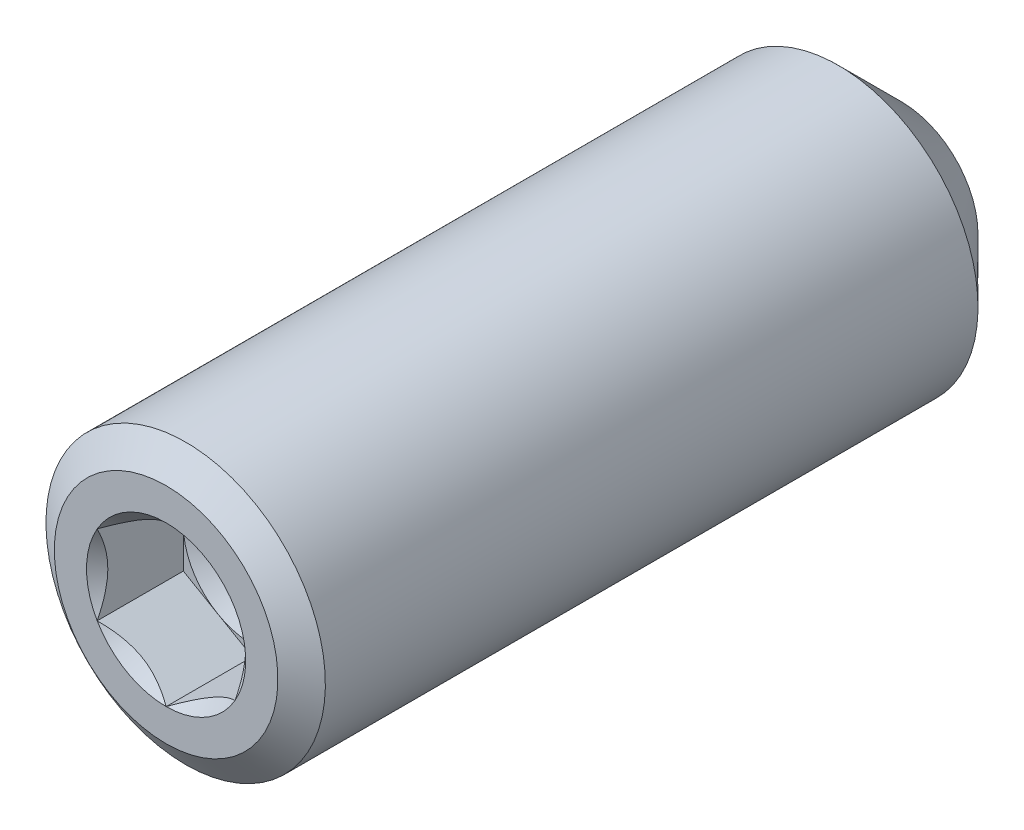
ISO-10303-21;
HEADER;
FILE_DESCRIPTION(('STEP AP214'),'2;1');
FILE_NAME('part.step','',(''),(''),'','','');
FILE_SCHEMA(('AUTOMOTIVE_DESIGN { 1 0 10303 214 1 1 1 1 }'));
ENDSEC;
DATA;
#1=APPLICATION_CONTEXT('core data for automotive mechanical design processes');
#2=APPLICATION_PROTOCOL_DEFINITION('international standard','automotive_design',2000,#1);
#3=PRODUCT_CONTEXT('',#1,'mechanical');
#4=PRODUCT('Part','Part','',(#3));
#5=PRODUCT_RELATED_PRODUCT_CATEGORY('part','',(#4));
#6=PRODUCT_DEFINITION_FORMATION('','',#4);
#7=PRODUCT_DEFINITION_CONTEXT('part definition',#1,'design');
#8=PRODUCT_DEFINITION('design','',#6,#7);
#9=PRODUCT_DEFINITION_SHAPE('','',#8);
#10=(LENGTH_UNIT() NAMED_UNIT(*) SI_UNIT(.MILLI.,.METRE.));
#11=(NAMED_UNIT(*) PLANE_ANGLE_UNIT() SI_UNIT($,.RADIAN.));
#12=(NAMED_UNIT(*) SI_UNIT($,.STERADIAN.) SOLID_ANGLE_UNIT());
#13=UNCERTAINTY_MEASURE_WITH_UNIT(LENGTH_MEASURE(1.E-05),#10,'distance_accuracy_value','');
#14=(GEOMETRIC_REPRESENTATION_CONTEXT(3) GLOBAL_UNCERTAINTY_ASSIGNED_CONTEXT((#13)) GLOBAL_UNIT_ASSIGNED_CONTEXT((#10,
#11,#12)) REPRESENTATION_CONTEXT('',''));
#15=CARTESIAN_POINT('',(0.,0.,0.));
#16=DIRECTION('',(0.,0.,1.));
#17=DIRECTION('',(1.,0.,0.));
#18=AXIS2_PLACEMENT_3D('',#15,#16,#17);
#19=CARTESIAN_POINT('',(1.190625,0.687407664253889,4.4644779821745));
#20=DIRECTION('',(0.,0.,-1.));
#21=DIRECTION('',(-1.,0.,0.));
#22=AXIS2_PLACEMENT_3D('',#19,#20,#21);
#23=PLANE('',#22);
#24=DIRECTION('',(0.,-1.,0.));
#25=VECTOR('',#24,1.);
#26=CARTESIAN_POINT('',(-1.190625,0.687407664253889,4.4644779821745));
#27=LINE('',#26,#25);
#28=CARTESIAN_POINT('',(-1.190625,0.687407664253889,4.4644779821745));
#29=VERTEX_POINT('',#28);
#30=CARTESIAN_POINT('',(-1.190625,0.,4.4644779821745));
#31=VERTEX_POINT('',#30);
#32=EDGE_CURVE('E166',#29,#31,#27,.T.);
#33=ORIENTED_EDGE('',*,*,#32,.T.);
#34=CARTESIAN_POINT('',(0.,0.,4.4644779821745));
#35=DIRECTION('',(0.,0.,1.));
#36=DIRECTION('',(1.,0.,0.));
#37=AXIS2_PLACEMENT_3D('',#34,#35,#36);
#38=CIRCLE('',#37,1.190625);
#39=CARTESIAN_POINT('',(-0.5953125,1.03111149638084,4.4644779821745));
#40=VERTEX_POINT('',#39);
#41=EDGE_CURVE('E61',#40,#31,#38,.T.);
#42=ORIENTED_EDGE('',*,*,#41,.F.);
#43=DIRECTION('',(-0.866025403784439,-0.5,0.));
#44=VECTOR('',#43,1.);
#45=CARTESIAN_POINT('',(0.,1.37481532850779,4.4644779821745));
#46=LINE('',#45,#44);
#47=EDGE_CURVE('E155',#40,#29,#46,.T.);
#48=ORIENTED_EDGE('',*,*,#47,.T.);
#49=EDGE_LOOP('',(#33,#42,#48));
#50=FACE_BOUND('',#49,.T.);
#51=ADVANCED_FACE('F40',(#50),#23,.F.);
#52=CARTESIAN_POINT('',(0.,1.37481532850779,4.4644779821745));
#53=VERTEX_POINT('',#52);
#54=EDGE_CURVE('E143',#53,#40,#46,.T.);
#55=ORIENTED_EDGE('',*,*,#54,.T.);
#56=CARTESIAN_POINT('',(0.5953125,1.03111149638084,4.4644779821745));
#57=VERTEX_POINT('',#56);
#58=EDGE_CURVE('E129',#57,#40,#38,.T.);
#59=ORIENTED_EDGE('',*,*,#58,.F.);
#60=DIRECTION('',(-0.866025403784439,0.5,0.));
#61=VECTOR('',#60,1.);
#62=CARTESIAN_POINT('',(1.190625,0.687407664253889,4.4644779821745));
#63=LINE('',#62,#61);
#64=EDGE_CURVE('E140',#57,#53,#63,.T.);
#65=ORIENTED_EDGE('',*,*,#64,.T.);
#66=EDGE_LOOP('',(#55,#59,#65));
#67=FACE_BOUND('',#66,.T.);
#68=ADVANCED_FACE('F139',(#67),#23,.F.);
#69=CARTESIAN_POINT('',(1.190625,0.687407664253889,4.4644779821745));
#70=VERTEX_POINT('',#69);
#71=EDGE_CURVE('E147',#70,#57,#63,.T.);
#72=ORIENTED_EDGE('',*,*,#71,.T.);
#73=CARTESIAN_POINT('',(1.190625,0.,4.4644779821745));
#74=VERTEX_POINT('',#73);
#75=EDGE_CURVE('E127',#74,#57,#38,.T.);
#76=ORIENTED_EDGE('',*,*,#75,.F.);
#77=DIRECTION('',(0.,1.,0.));
#78=VECTOR('',#77,1.);
#79=CARTESIAN_POINT('',(1.190625,-0.687407664253909,4.4644779821745));
#80=LINE('',#79,#78);
#81=EDGE_CURVE('E153',#74,#70,#80,.T.);
#82=ORIENTED_EDGE('',*,*,#81,.T.);
#83=EDGE_LOOP('',(#72,#76,#82));
#84=FACE_BOUND('',#83,.T.);
#85=ADVANCED_FACE('F152',(#84),#23,.F.);
#86=CARTESIAN_POINT('',(1.190625,-0.687407664253909,4.4644779821745));
#87=VERTEX_POINT('',#86);
#88=EDGE_CURVE('E177',#87,#74,#80,.T.);
#89=ORIENTED_EDGE('',*,*,#88,.T.);
#90=CARTESIAN_POINT('',(0.5953125,-1.03111149638086,4.4644779821745));
#91=VERTEX_POINT('',#90);
#92=EDGE_CURVE('E131',#91,#74,#38,.T.);
#93=ORIENTED_EDGE('',*,*,#92,.F.);
#94=DIRECTION('',(0.866025403784439,0.5,0.));
#95=VECTOR('',#94,1.);
#96=CARTESIAN_POINT('',(0.,-1.37481532850781,4.4644779821745));
#97=LINE('',#96,#95);
#98=EDGE_CURVE('E173',#91,#87,#97,.T.);
#99=ORIENTED_EDGE('',*,*,#98,.T.);
#100=EDGE_LOOP('',(#89,#93,#99));
#101=FACE_BOUND('',#100,.T.);
#102=ADVANCED_FACE('F256',(#101),#23,.F.);
#103=CARTESIAN_POINT('',(0.,-1.37481532850781,4.4644779821745));
#104=VERTEX_POINT('',#103);
#105=EDGE_CURVE('E174',#104,#91,#97,.T.);
#106=ORIENTED_EDGE('',*,*,#105,.T.);
#107=CARTESIAN_POINT('',(-0.5953125,-1.03111149638086,4.4644779821745));
#108=VERTEX_POINT('',#107);
#109=EDGE_CURVE('E266',#108,#91,#38,.T.);
#110=ORIENTED_EDGE('',*,*,#109,.F.);
#111=DIRECTION('',(0.866025403784439,-0.5,0.));
#112=VECTOR('',#111,1.);
#113=CARTESIAN_POINT('',(-1.190625,-0.687407664253908,4.4644779821745));
#114=LINE('',#113,#112);
#115=EDGE_CURVE('E169',#108,#104,#114,.T.);
#116=ORIENTED_EDGE('',*,*,#115,.T.);
#117=EDGE_LOOP('',(#106,#110,#116));
#118=FACE_BOUND('',#117,.T.);
#119=ADVANCED_FACE('F246',(#118),#23,.F.);
#120=CARTESIAN_POINT('',(0.,0.,5.9527592321745));
#121=DIRECTION('',(0.,0.,-1.));
#122=DIRECTION('',(0.,1.,0.));
#123=AXIS2_PLACEMENT_3D('',#120,#121,#122);
#124=PLANE('',#123);
#125=CARTESIAN_POINT('',(0.,0.,5.9527592321745));
#126=DIRECTION('',(0.,0.,1.));
#127=DIRECTION('',(1.,0.,0.));
#128=AXIS2_PLACEMENT_3D('',#125,#126,#127);
#129=CIRCLE('',#128,1.3748153285078);
#130=CARTESIAN_POINT('',(0.,1.37481532850779,5.9527592321745));
#131=VERTEX_POINT('',#130);
#132=CARTESIAN_POINT('',(-1.19062500000001,0.687407664253884,5.9527592321745));
#133=VERTEX_POINT('',#132);
#134=EDGE_CURVE('E282',#131,#133,#129,.T.);
#135=ORIENTED_EDGE('',*,*,#134,.F.);
#136=CARTESIAN_POINT('',(1.190625,0.687407664253901,5.9527592321745));
#137=VERTEX_POINT('',#136);
#138=EDGE_CURVE('E278',#137,#131,#129,.T.);
#139=ORIENTED_EDGE('',*,*,#138,.F.);
#140=CARTESIAN_POINT('',(1.19062500000001,-0.687407664253903,5.9527592321745));
#141=VERTEX_POINT('',#140);
#142=EDGE_CURVE('E68',#141,#137,#129,.T.);
#143=ORIENTED_EDGE('',*,*,#142,.F.);
#144=CARTESIAN_POINT('',(0.,-1.37481532850781,5.9527592321745));
#145=VERTEX_POINT('',#144);
#146=EDGE_CURVE('E358',#145,#141,#129,.T.);
#147=ORIENTED_EDGE('',*,*,#146,.F.);
#148=CARTESIAN_POINT('',(-1.190625,-0.68740766425392,5.9527592321745));
#149=VERTEX_POINT('',#148);
#150=EDGE_CURVE('E337',#149,#145,#129,.T.);
#151=ORIENTED_EDGE('',*,*,#150,.F.);
#152=EDGE_CURVE('E344',#133,#149,#129,.T.);
#153=ORIENTED_EDGE('',*,*,#152,.F.);
#154=EDGE_LOOP('',(#135,#139,#143,#147,#151,#153));
#155=FACE_BOUND('',#154,.T.);
#156=CARTESIAN_POINT('',(0.,0.,5.9527592321745));
#157=DIRECTION('',(0.,0.,1.));
#158=DIRECTION('',(0.,-1.,0.));
#159=AXIS2_PLACEMENT_3D('',#156,#157,#158);
#160=CIRCLE('',#159,1.93040000000002);
#161=CARTESIAN_POINT('',(0.,-1.93040000000003,5.9527592321745));
#162=VERTEX_POINT('',#161);
#163=EDGE_CURVE('E54',#162,#162,#160,.T.);
#164=ORIENTED_EDGE('',*,*,#163,.T.);
#165=EDGE_LOOP('',(#164));
#166=FACE_BOUND('',#165,.T.);
#167=ADVANCED_FACE('F42',(#155,#166),#124,.F.);
#168=CARTESIAN_POINT('',(0.,0.,5.61483907423449));
#169=DIRECTION('',(0.,0.,-1.));
#170=DIRECTION('',(0.,1.,0.));
#171=AXIS2_PLACEMENT_3D('',#168,#169,#170);
#172=CONICAL_SURFACE('',#171,2.41300000000002,0.959931088596882);
#173=ORIENTED_EDGE('',*,*,#163,.F.);
#174=EDGE_LOOP('',(#173));
#175=FACE_BOUND('',#174,.T.);
#176=CARTESIAN_POINT('',(0.,0.,5.61483907423449));
#177=DIRECTION('',(0.,0.,1.));
#178=DIRECTION('',(0.,-1.,0.));
#179=AXIS2_PLACEMENT_3D('',#176,#177,#178);
#180=CIRCLE('',#179,2.41300000000002);
#181=CARTESIAN_POINT('',(0.,-2.41300000000003,5.61483907423449));
#182=VERTEX_POINT('',#181);
#183=EDGE_CURVE('E201',#182,#182,#180,.T.);
#184=ORIENTED_EDGE('',*,*,#183,.T.);
#185=EDGE_LOOP('',(#184));
#186=FACE_BOUND('',#185,.T.);
#187=ADVANCED_FACE('F207',(#175,#186),#172,.T.);
#188=CARTESIAN_POINT('',(0.,0.,-5.9527592321745));
#189=DIRECTION('',(0.,0.,1.));
#190=DIRECTION('',(0.,-1.,0.));
#191=AXIS2_PLACEMENT_3D('',#188,#189,#190);
#192=CYLINDRICAL_SURFACE('',#191,2.41300000000001);
#193=ORIENTED_EDGE('',*,*,#183,.F.);
#194=EDGE_LOOP('',(#193));
#195=FACE_BOUND('',#194,.T.);
#196=CARTESIAN_POINT('',(0.,0.,-5.6564800867158));
#197=DIRECTION('',(0.,0.,1.));
#198=DIRECTION('',(0.,-1.,0.));
#199=AXIS2_PLACEMENT_3D('',#196,#197,#198);
#200=CIRCLE('',#199,2.413);
#201=CARTESIAN_POINT('',(0.,-2.413,-5.6564800867158));
#202=VERTEX_POINT('',#201);
#203=EDGE_CURVE('E198',#202,#202,#200,.T.);
#204=ORIENTED_EDGE('',*,*,#203,.T.);
#205=EDGE_LOOP('',(#204));
#206=FACE_BOUND('',#205,.T.);
#207=ADVANCED_FACE('F210',(#195,#206),#192,.T.);
#208=CARTESIAN_POINT('',(0.,0.,-6.7472407678255));
#209=DIRECTION('',(0.,0.,1.));
#210=DIRECTION('',(0.,-1.,0.));
#211=AXIS2_PLACEMENT_3D('',#208,#209,#210);
#212=CONICAL_SURFACE('',#211,1.32223931889029,0.785398163397455);
#213=ORIENTED_EDGE('',*,*,#203,.F.);
#214=EDGE_LOOP('',(#213));
#215=FACE_BOUND('',#214,.T.);
#216=CARTESIAN_POINT('',(0.,0.,-6.7472407678255));
#217=DIRECTION('',(0.,0.,1.));
#218=DIRECTION('',(0.,-1.,0.));
#219=AXIS2_PLACEMENT_3D('',#216,#217,#218);
#220=CIRCLE('',#219,1.32223931889029);
#221=CARTESIAN_POINT('',(0.,-1.32223931889029,-6.7472407678255));
#222=VERTEX_POINT('',#221);
#223=EDGE_CURVE('E182',#222,#222,#220,.T.);
#224=ORIENTED_EDGE('',*,*,#223,.T.);
#225=EDGE_LOOP('',(#224));
#226=FACE_BOUND('',#225,.T.);
#227=ADVANCED_FACE('F215',(#215,#226),#212,.T.);
#228=CARTESIAN_POINT('',(0.,0.,-5.9527592321745));
#229=DIRECTION('',(0.,0.,-1.));
#230=DIRECTION('',(0.,1.,0.));
#231=AXIS2_PLACEMENT_3D('',#228,#229,#230);
#232=CONICAL_SURFACE('',#231,0.,1.02974425867666);
#233=ORIENTED_EDGE('',*,*,#223,.F.);
#234=EDGE_LOOP('',(#233));
#235=FACE_BOUND('',#234,.T.);
#236=CARTESIAN_POINT('',(0.,0.,-5.9527592321745));
#237=VERTEX_POINT('',#236);
#238=VERTEX_LOOP('',#237);
#239=FACE_BOUND('',#238,.T.);
#240=ADVANCED_FACE('F221',(#235,#239),#232,.F.);
#241=CARTESIAN_POINT('',(0.,0.,5.9527592321745));
#242=DIRECTION('',(0.,0.,1.));
#243=DIRECTION('',(1.,0.,0.));
#244=AXIS2_PLACEMENT_3D('',#241,#242,#243);
#245=CONICAL_SURFACE('',#244,1.3748153285078,0.78539816339745);
#246=ORIENTED_EDGE('',*,*,#134,.T.);
#247=CARTESIAN_POINT('',(0.000200000000000267,1.37493079856163,5.95287471677452));
#248=CARTESIAN_POINT('',(-0.0407344195898562,1.3512973003923,5.92925799638876));
#249=CARTESIAN_POINT('',(-0.0823533883019738,1.32726857760296,5.90702801389762));
#250=CARTESIAN_POINT('',(-0.167219443673632,1.27827113768908,5.86632489480193));
#251=CARTESIAN_POINT('',(-0.210474607290961,1.25329775733077,5.84787441482205));
#252=CARTESIAN_POINT('',(-0.297696647457424,1.20294008896139,5.81626807017882));
#253=CARTESIAN_POINT('',(-0.341641294957925,1.17756863489754,5.80303273641781));
#254=CARTESIAN_POINT('',(-0.430498374163694,1.12626697629868,5.78264068374989));
#255=CARTESIAN_POINT('',(-0.475408088834755,1.10033834044412,5.77546873507049));
#256=CARTESIAN_POINT('',(-0.552804127656979,1.05565371659589,5.76899777082335));
#257=CARTESIAN_POINT('',(-0.585190412515647,1.03695548631469,5.76803955232129));
#258=CARTESIAN_POINT('',(-0.649906073317771,0.9995918821298,5.76965188124658));
#259=CARTESIAN_POINT('',(-0.682235435127273,0.980926516386355,5.77222320735408));
#260=CARTESIAN_POINT('',(-0.746582156071485,0.943775919727744,5.78074598616812));
#261=CARTESIAN_POINT('',(-0.778599196336769,0.925290872911927,5.78670058692706));
#262=CARTESIAN_POINT('',(-0.842098763396458,0.888629380776591,5.8016691962457));
#263=CARTESIAN_POINT('',(-0.873581054644165,0.870453071450021,5.81068451808655));
#264=CARTESIAN_POINT('',(-0.954214838572128,0.823899134593434,5.83744152801251));
#265=CARTESIAN_POINT('',(-1.00285783526766,0.795815087357079,5.85719604661051));
#266=CARTESIAN_POINT('',(-1.09823941635212,0.740746505842234,5.90169600113218));
#267=CARTESIAN_POINT('',(-1.14498361758716,0.713758728676131,5.92642519689066));
#268=CARTESIAN_POINT('',(-1.190825,0.687292194200051,5.95287471677452));
#269=B_SPLINE_CURVE_WITH_KNOTS('',3,(#247,#248,#249,#250,#251,#252,#253,#254,#255,#256,#257,
#258,#259,#260,#261,#262,#263,#264,#265,#266,#267,#268),.UNSPECIFIED.,.F.,.F.,(4,2,2,2,2,2,2,2,
2,2,4),(0.,0.15862567293412,0.318176079843271,0.475191357500656,0.631811068630749,
0.743878551794719,0.85597076300703,0.968167444423243,1.08041232768377,1.25873351645467,
1.43648174479847),.UNSPECIFIED.);
#270=EDGE_CURVE('E11',#131,#133,#269,.T.);
#271=ORIENTED_EDGE('',*,*,#270,.F.);
#272=EDGE_LOOP('',(#246,#271));
#273=FACE_BOUND('',#272,.T.);
#274=ADVANCED_FACE('F227',(#273),#245,.F.);
#275=ORIENTED_EDGE('',*,*,#152,.T.);
#276=CARTESIAN_POINT('',(-1.190625,-1.37097145294695,6.39374967946444));
#277=CARTESIAN_POINT('',(-1.190625,-1.33758920637891,6.36854922098232));
#278=CARTESIAN_POINT('',(-1.190625,-1.30402095496659,6.34359585241195));
#279=CARTESIAN_POINT('',(-1.190625,-1.23643692297762,6.2942853193517));
#280=CARTESIAN_POINT('',(-1.190625,-1.20242103219113,6.26992830607387));
#281=CARTESIAN_POINT('',(-1.190625,-1.09909081482556,6.19755744116371));
#282=CARTESIAN_POINT('',(-1.190625,-1.02900143506768,6.15063185477006));
#283=CARTESIAN_POINT('',(-1.190625,-0.88202673742424,6.05851133550013));
#284=CARTESIAN_POINT('',(-1.190625,-0.804981866019991,6.01356806941656));
#285=CARTESIAN_POINT('',(-1.190625,-0.647043893307975,5.93135725668137));
#286=CARTESIAN_POINT('',(-1.190625,-0.566164943702931,5.89406383390662));
#287=CARTESIAN_POINT('',(-1.190625,-0.444764933868866,5.84843878773759));
#288=CARTESIAN_POINT('',(-1.190625,-0.406041211486724,5.83534407119598));
#289=CARTESIAN_POINT('',(-1.190625,-0.327658904711943,5.81226350807114));
#290=CARTESIAN_POINT('',(-1.190625,-0.288000256118262,5.80227787566045));
#291=CARTESIAN_POINT('',(-1.190625,-0.208647693212107,5.78610046123975));
#292=CARTESIAN_POINT('',(-1.190625,-0.168967240621972,5.77984367802348));
#293=CARTESIAN_POINT('',(-1.190625,-0.0891819742965439,5.77124612059301));
#294=CARTESIAN_POINT('',(-1.190625,-0.0490772347013231,5.76890467322439));
#295=CARTESIAN_POINT('',(-1.190625,0.0297075773931657,5.76831147624215));
#296=CARTESIAN_POINT('',(-1.190625,0.0683866068287978,5.76991458597055));
#297=CARTESIAN_POINT('',(-1.190625,0.145416876633139,5.77680225991901));
#298=CARTESIAN_POINT('',(-1.190625,0.183768052740668,5.78208752984298));
#299=CARTESIAN_POINT('',(-1.190625,0.260508634904933,5.79614064440736));
#300=CARTESIAN_POINT('',(-1.190625,0.298887052039121,5.80496759478031));
#301=CARTESIAN_POINT('',(-1.190625,0.374805334250653,5.82563494215512));
#302=CARTESIAN_POINT('',(-1.190625,0.412345269207083,5.83747508701044));
#303=CARTESIAN_POINT('',(-1.190625,0.530535580908829,5.87920656584169));
#304=CARTESIAN_POINT('',(-1.190625,0.609503725744436,5.91385062908884));
#305=CARTESIAN_POINT('',(-1.190625,0.763730269113456,5.99087748414936));
#306=CARTESIAN_POINT('',(-1.190625,0.838974064674595,6.03328807884316));
#307=CARTESIAN_POINT('',(-1.190625,0.982775796189608,6.12078487719946));
#308=CARTESIAN_POINT('',(-1.190625,1.05148016607043,6.16563339422972));
#309=CARTESIAN_POINT('',(-1.190625,1.15270222256252,6.2349645620971));
#310=CARTESIAN_POINT('',(-1.190625,1.18600604145833,6.25831940851167));
#311=CARTESIAN_POINT('',(-1.190625,1.25215860362231,6.30564680119381));
#312=CARTESIAN_POINT('',(-1.190625,1.28500746868278,6.32961917703278));
#313=CARTESIAN_POINT('',(-1.190625,1.31766689427972,6.35384759894575));
#314=B_SPLINE_CURVE_WITH_KNOTS('',3,(#276,#277,#278,#279,#280,#281,#282,#283,#284,#285,#286,
#287,#288,#289,#290,#291,#292,#293,#294,#295,#296,#297,#298,#299,#300,#301,#302,#303,#304,#305,
#306,#307,#308,#309,#310,#311,#312,#313),.UNSPECIFIED.,.F.,.F.,(4,2,2,2,2,2,2,2,2,2,2,2,2,2,2,2,
2,2,4),(0.,0.12547564476333,0.250982782413967,0.503912518769174,0.771279184643225,
1.03772598255657,1.16025581644629,1.28279408906665,1.40312855503247,1.5234423300503,
1.63939577664877,1.75537145240478,1.87336894094838,1.99135655861153,2.24929724983449,
2.50818004711563,2.75419821472196,2.87622362118597,2.99821570388961),.UNSPECIFIED.);
#315=EDGE_CURVE('E281',#133,#149,#314,.F.);
#316=ORIENTED_EDGE('',*,*,#315,.F.);
#317=EDGE_LOOP('',(#275,#316));
#318=FACE_BOUND('',#317,.T.);
#319=ADVANCED_FACE('F232',(#318),#245,.F.);
#320=ORIENTED_EDGE('',*,*,#150,.T.);
#321=CARTESIAN_POINT('',(-1.190825,-0.68729219420007,5.95287471677452));
#322=CARTESIAN_POINT('',(-1.14989058041014,-0.710925692369395,5.92925799638876));
#323=CARTESIAN_POINT('',(-1.10827161169803,-0.73495441515873,5.90702801389762));
#324=CARTESIAN_POINT('',(-1.02340555632637,-0.783951855072619,5.86632489480193));
#325=CARTESIAN_POINT('',(-0.98015039270904,-0.808925235430925,5.84787441482205));
#326=CARTESIAN_POINT('',(-0.892928352542576,-0.859282903800301,5.81626807017882));
#327=CARTESIAN_POINT('',(-0.848983705042075,-0.884654357864158,5.80303273641781));
#328=CARTESIAN_POINT('',(-0.760126625836307,-0.935956016463013,5.78264068374989));
#329=CARTESIAN_POINT('',(-0.715216911165245,-0.961884652317579,5.77546873507049));
#330=CARTESIAN_POINT('',(-0.637820872343022,-1.0065692761658,5.76899777082335));
#331=CARTESIAN_POINT('',(-0.605434587484354,-1.025267506447,5.76803955232129));
#332=CARTESIAN_POINT('',(-0.540718926682231,-1.0626311106319,5.76965188124658));
#333=CARTESIAN_POINT('',(-0.508389564872728,-1.08129647637534,5.77222320735408));
#334=CARTESIAN_POINT('',(-0.444042843928516,-1.11844707303395,5.78074598616812));
#335=CARTESIAN_POINT('',(-0.412025803663233,-1.13693211984977,5.78670058692706));
#336=CARTESIAN_POINT('',(-0.348526236603543,-1.1735936119851,5.8016691962457));
#337=CARTESIAN_POINT('',(-0.317043945355836,-1.19176992131167,5.81068451808655));
#338=CARTESIAN_POINT('',(-0.236410161427874,-1.23832385816826,5.83744152801251));
#339=CARTESIAN_POINT('',(-0.187767164732342,-1.26640790540462,5.8571960466105));
#340=CARTESIAN_POINT('',(-0.0923855836478816,-1.32147648691946,5.90169600113218));
#341=CARTESIAN_POINT('',(-0.0456413824128451,-1.34846426408556,5.92642519689065));
#342=CARTESIAN_POINT('',(0.000199999999999595,-1.37493079856164,5.95287471677452));
#343=B_SPLINE_CURVE_WITH_KNOTS('',3,(#321,#322,#323,#324,#325,#326,#327,#328,#329,#330,#331,
#332,#333,#334,#335,#336,#337,#338,#339,#340,#341,#342),.UNSPECIFIED.,.F.,.F.,(4,2,2,2,2,2,2,2,
2,2,4),(0.,0.15862567293412,0.318176079843271,0.475191357500655,0.631811068630748,
0.743878551794718,0.855970763007029,0.968167444423241,1.08041232768377,1.25873351645467,
1.43648174479847),.UNSPECIFIED.);
#344=EDGE_CURVE('E290',#149,#145,#343,.T.);
#345=ORIENTED_EDGE('',*,*,#344,.F.);
#346=EDGE_LOOP('',(#320,#345));
#347=FACE_BOUND('',#346,.T.);
#348=ADVANCED_FACE('F336',(#347),#245,.F.);
#349=ORIENTED_EDGE('',*,*,#146,.T.);
#350=CARTESIAN_POINT('',(-0.000200000000000156,-1.37493079856164,5.95287471677452));
#351=CARTESIAN_POINT('',(0.0407344195898563,-1.35129730039232,5.92925799638876));
#352=CARTESIAN_POINT('',(0.0823533883019738,-1.32726857760298,5.90702801389762));
#353=CARTESIAN_POINT('',(0.167219443673632,-1.2782711376891,5.86632489480193));
#354=CARTESIAN_POINT('',(0.210474607290961,-1.25329775733079,5.84787441482205));
#355=CARTESIAN_POINT('',(0.297696647457424,-1.20294008896141,5.81626807017882));
#356=CARTESIAN_POINT('',(0.341641294957925,-1.17756863489756,5.80303273641781));
#357=CARTESIAN_POINT('',(0.430498374163694,-1.1262669762987,5.78264068374989));
#358=CARTESIAN_POINT('',(0.475408088834755,-1.10033834044414,5.77546873507049));
#359=CARTESIAN_POINT('',(0.552804127656978,-1.05565371659591,5.76899777082335));
#360=CARTESIAN_POINT('',(0.585190412515646,-1.03695548631471,5.76803955232129));
#361=CARTESIAN_POINT('',(0.64990607331777,-0.99959188212982,5.76965188124658));
#362=CARTESIAN_POINT('',(0.682235435127272,-0.980926516386374,5.77222320735408));
#363=CARTESIAN_POINT('',(0.746582156071484,-0.943775919727764,5.78074598616812));
#364=CARTESIAN_POINT('',(0.778599196336768,-0.925290872911947,5.78670058692706));
#365=CARTESIAN_POINT('',(0.842098763396457,-0.888629380776611,5.8016691962457));
#366=CARTESIAN_POINT('',(0.873581054644164,-0.870453071450041,5.81068451808655));
#367=CARTESIAN_POINT('',(0.954214838572127,-0.823899134593454,5.83744152801251));
#368=CARTESIAN_POINT('',(1.00285783526766,-0.795815087357099,5.8571960466105));
#369=CARTESIAN_POINT('',(1.09823941635212,-0.740746505842254,5.90169600113218));
#370=CARTESIAN_POINT('',(1.14498361758715,-0.713758728676151,5.92642519689066));
#371=CARTESIAN_POINT('',(1.190825,-0.687292194200071,5.95287471677452));
#372=B_SPLINE_CURVE_WITH_KNOTS('',3,(#350,#351,#352,#353,#354,#355,#356,#357,#358,#359,#360,
#361,#362,#363,#364,#365,#366,#367,#368,#369,#370,#371),.UNSPECIFIED.,.F.,.F.,(4,2,2,2,2,2,2,2,
2,2,4),(0.,0.15862567293412,0.318176079843271,0.475191357500656,0.631811068630749,
0.743878551794718,0.855970763007029,0.968167444423242,1.08041232768377,1.25873351645467,
1.43648174479847),.UNSPECIFIED.);
#373=EDGE_CURVE('E323',#145,#141,#372,.T.);
#374=ORIENTED_EDGE('',*,*,#373,.F.);
#375=EDGE_LOOP('',(#349,#374));
#376=FACE_BOUND('',#375,.T.);
#377=ADVANCED_FACE('F350',(#376),#245,.F.);
#378=ORIENTED_EDGE('',*,*,#142,.T.);
#379=CARTESIAN_POINT('',(1.190625,-1.37097145294695,6.39374967946444));
#380=CARTESIAN_POINT('',(1.190625,-1.33758920637891,6.36854922098233));
#381=CARTESIAN_POINT('',(1.190625,-1.30402095496659,6.34359585241195));
#382=CARTESIAN_POINT('',(1.190625,-1.23643692297762,6.2942853193517));
#383=CARTESIAN_POINT('',(1.190625,-1.20242103219113,6.26992830607387));
#384=CARTESIAN_POINT('',(1.190625,-1.09909081482556,6.19755744116371));
#385=CARTESIAN_POINT('',(1.190625,-1.02900143506768,6.15063185477006));
#386=CARTESIAN_POINT('',(1.190625,-0.882026737424241,6.05851133550013));
#387=CARTESIAN_POINT('',(1.190625,-0.804981866019993,6.01356806941656));
#388=CARTESIAN_POINT('',(1.190625,-0.647043893307976,5.93135725668137));
#389=CARTESIAN_POINT('',(1.190625,-0.566164943702932,5.89406383390662));
#390=CARTESIAN_POINT('',(1.190625,-0.444764933868867,5.84843878773759));
#391=CARTESIAN_POINT('',(1.190625,-0.406041211486725,5.83534407119598));
#392=CARTESIAN_POINT('',(1.190625,-0.327658904711944,5.81226350807114));
#393=CARTESIAN_POINT('',(1.190625,-0.288000256118263,5.80227787566045));
#394=CARTESIAN_POINT('',(1.190625,-0.208647693212108,5.78610046123975));
#395=CARTESIAN_POINT('',(1.190625,-0.168967240621973,5.77984367802348));
#396=CARTESIAN_POINT('',(1.190625,-0.0891819742965444,5.77124612059301));
#397=CARTESIAN_POINT('',(1.190625,-0.0490772347013234,5.76890467322439));
#398=CARTESIAN_POINT('',(1.190625,0.0297075773931656,5.76831147624215));
#399=CARTESIAN_POINT('',(1.190625,0.0683866068287977,5.76991458597055));
#400=CARTESIAN_POINT('',(1.190625,0.145416876633139,5.77680225991901));
#401=CARTESIAN_POINT('',(1.190625,0.183768052740668,5.78208752984298));
#402=CARTESIAN_POINT('',(1.190625,0.260508634904933,5.79614064440736));
#403=CARTESIAN_POINT('',(1.190625,0.298887052039121,5.80496759478031));
#404=CARTESIAN_POINT('',(1.190625,0.374805334250653,5.82563494215512));
#405=CARTESIAN_POINT('',(1.190625,0.412345269207083,5.83747508701043));
#406=CARTESIAN_POINT('',(1.190625,0.530535580908828,5.87920656584169));
#407=CARTESIAN_POINT('',(1.190625,0.609503725744436,5.91385062908884));
#408=CARTESIAN_POINT('',(1.190625,0.763730269113455,5.99087748414936));
#409=CARTESIAN_POINT('',(1.190625,0.838974064674594,6.03328807884316));
#410=CARTESIAN_POINT('',(1.190625,0.982775796189607,6.12078487719945));
#411=CARTESIAN_POINT('',(1.190625,1.05148016607043,6.16563339422972));
#412=CARTESIAN_POINT('',(1.190625,1.15270222256252,6.2349645620971));
#413=CARTESIAN_POINT('',(1.190625,1.18600604145833,6.25831940851167));
#414=CARTESIAN_POINT('',(1.190625,1.2521586036223,6.30564680119381));
#415=CARTESIAN_POINT('',(1.190625,1.28500746868277,6.32961917703278));
#416=CARTESIAN_POINT('',(1.190625,1.31766689427972,6.35384759894575));
#417=B_SPLINE_CURVE_WITH_KNOTS('',3,(#379,#380,#381,#382,#383,#384,#385,#386,#387,#388,#389,
#390,#391,#392,#393,#394,#395,#396,#397,#398,#399,#400,#401,#402,#403,#404,#405,#406,#407,#408,
#409,#410,#411,#412,#413,#414,#415,#416),.UNSPECIFIED.,.F.,.F.,(4,2,2,2,2,2,2,2,2,2,2,2,2,2,2,2,
2,2,4),(0.,0.125475644763331,0.250982782413968,0.503912518769175,0.771279184643226,
1.03772598255657,1.1602558164463,1.28279408906666,1.40312855503247,1.5234423300503,
1.63939577664877,1.75537145240478,1.87336894094838,1.99135655861153,2.24929724983449,
2.50818004711563,2.75419821472196,2.87622362118597,2.99821570388961),.UNSPECIFIED.);
#418=EDGE_CURVE('E317',#141,#137,#417,.T.);
#419=ORIENTED_EDGE('',*,*,#418,.F.);
#420=EDGE_LOOP('',(#378,#419));
#421=FACE_BOUND('',#420,.T.);
#422=ADVANCED_FACE('F253',(#421),#245,.F.);
#423=ORIENTED_EDGE('',*,*,#138,.T.);
#424=CARTESIAN_POINT('',(1.190825,0.687292194200051,5.95287471677452));
#425=CARTESIAN_POINT('',(1.14989058041014,0.710925692369376,5.92925799638876));
#426=CARTESIAN_POINT('',(1.10827161169803,0.734954415158712,5.90702801389762));
#427=CARTESIAN_POINT('',(1.02340555632637,0.7839518550726,5.86632489480193));
#428=CARTESIAN_POINT('',(0.980150392709039,0.808925235430906,5.84787441482205));
#429=CARTESIAN_POINT('',(0.892928352542576,0.859282903800282,5.81626807017882));
#430=CARTESIAN_POINT('',(0.848983705042075,0.884654357864139,5.80303273641781));
#431=CARTESIAN_POINT('',(0.760126625836306,0.935956016462994,5.78264068374989));
#432=CARTESIAN_POINT('',(0.715216911165245,0.961884652317561,5.77546873507049));
#433=CARTESIAN_POINT('',(0.637820872343022,1.00656927616578,5.76899777082335));
#434=CARTESIAN_POINT('',(0.605434587484353,1.02526750644699,5.76803955232129));
#435=CARTESIAN_POINT('',(0.54071892668223,1.06263111063188,5.76965188124658));
#436=CARTESIAN_POINT('',(0.508389564872727,1.08129647637532,5.77222320735408));
#437=CARTESIAN_POINT('',(0.444042843928515,1.11844707303393,5.78074598616812));
#438=CARTESIAN_POINT('',(0.412025803663232,1.13693211984975,5.78670058692706));
#439=CARTESIAN_POINT('',(0.348526236603543,1.17359361198508,5.8016691962457));
#440=CARTESIAN_POINT('',(0.317043945355836,1.19176992131165,5.81068451808655));
#441=CARTESIAN_POINT('',(0.236410161427873,1.23832385816824,5.83744152801251));
#442=CARTESIAN_POINT('',(0.187767164732342,1.2664079054046,5.85719604661051));
#443=CARTESIAN_POINT('',(0.0923855836478816,1.32147648691944,5.90169600113218));
#444=CARTESIAN_POINT('',(0.0456413824128451,1.34846426408554,5.92642519689066));
#445=CARTESIAN_POINT('',(-0.000199999999999601,1.37493079856163,5.95287471677452));
#446=B_SPLINE_CURVE_WITH_KNOTS('',3,(#424,#425,#426,#427,#428,#429,#430,#431,#432,#433,#434,
#435,#436,#437,#438,#439,#440,#441,#442,#443,#444,#445),.UNSPECIFIED.,.F.,.F.,(4,2,2,2,2,2,2,2,
2,2,4),(0.,0.15862567293412,0.318176079843271,0.475191357500655,0.631811068630748,
0.743878551794718,0.855970763007029,0.968167444423242,1.08041232768377,1.25873351645467,
1.43648174479847),.UNSPECIFIED.);
#447=EDGE_CURVE('E150',#137,#131,#446,.T.);
#448=ORIENTED_EDGE('',*,*,#447,.F.);
#449=EDGE_LOOP('',(#423,#448));
#450=FACE_BOUND('',#449,.T.);
#451=ADVANCED_FACE('F234',(#450),#245,.F.);
#452=CARTESIAN_POINT('',(-1.190625,-0.687407664253908,4.4644779821745));
#453=VERTEX_POINT('',#452);
#454=EDGE_CURVE('E170',#453,#108,#114,.T.);
#455=ORIENTED_EDGE('',*,*,#454,.T.);
#456=EDGE_CURVE('E276',#31,#108,#38,.T.);
#457=ORIENTED_EDGE('',*,*,#456,.F.);
#458=EDGE_CURVE('E165',#31,#453,#27,.T.);
#459=ORIENTED_EDGE('',*,*,#458,.T.);
#460=EDGE_LOOP('',(#455,#457,#459));
#461=FACE_BOUND('',#460,.T.);
#462=ADVANCED_FACE('F238',(#461),#23,.F.);
#463=CARTESIAN_POINT('',(0.,1.37481532850779,4.4644779821745));
#464=DIRECTION('',(-0.5,0.866025403784439,0.));
#465=DIRECTION('',(-0.866025403784439,-0.5,0.));
#466=AXIS2_PLACEMENT_3D('',#463,#464,#465);
#467=PLANE('',#466);
#468=DIRECTION('',(0.,0.,1.));
#469=VECTOR('',#468,1.);
#470=CARTESIAN_POINT('',(0.,1.37481532850779,4.4644779821745));
#471=LINE('',#470,#469);
#472=EDGE_CURVE('E149',#53,#131,#471,.T.);
#473=ORIENTED_EDGE('',*,*,#472,.T.);
#474=ORIENTED_EDGE('',*,*,#270,.T.);
#475=DIRECTION('',(0.,0.,1.));
#476=VECTOR('',#475,1.);
#477=CARTESIAN_POINT('',(-1.190625,0.687407664253889,4.4644779821745));
#478=LINE('',#477,#476);
#479=EDGE_CURVE('E192',#29,#133,#478,.T.);
#480=ORIENTED_EDGE('',*,*,#479,.F.);
#481=ORIENTED_EDGE('',*,*,#47,.F.);
#482=ORIENTED_EDGE('',*,*,#54,.F.);
#483=EDGE_LOOP('',(#473,#474,#480,#481,#482));
#484=FACE_BOUND('',#483,.T.);
#485=ADVANCED_FACE('F244',(#484),#467,.F.);
#486=CARTESIAN_POINT('',(-1.190625,0.687407664253889,4.4644779821745));
#487=DIRECTION('',(-1.,0.,0.));
#488=DIRECTION('',(0.,0.,1.));
#489=AXIS2_PLACEMENT_3D('',#486,#487,#488);
#490=PLANE('',#489);
#491=ORIENTED_EDGE('',*,*,#479,.T.);
#492=ORIENTED_EDGE('',*,*,#315,.T.);
#493=DIRECTION('',(0.,0.,1.));
#494=VECTOR('',#493,1.);
#495=CARTESIAN_POINT('',(-1.190625,-0.687407664253908,4.4644779821745));
#496=LINE('',#495,#494);
#497=EDGE_CURVE('E189',#453,#149,#496,.T.);
#498=ORIENTED_EDGE('',*,*,#497,.F.);
#499=ORIENTED_EDGE('',*,*,#458,.F.);
#500=ORIENTED_EDGE('',*,*,#32,.F.);
#501=EDGE_LOOP('',(#491,#492,#498,#499,#500));
#502=FACE_BOUND('',#501,.T.);
#503=ADVANCED_FACE('F251',(#502),#490,.F.);
#504=CARTESIAN_POINT('',(-1.190625,-0.687407664253908,4.4644779821745));
#505=DIRECTION('',(-0.5,-0.866025403784439,0.));
#506=DIRECTION('',(0.866025403784439,-0.5,0.));
#507=AXIS2_PLACEMENT_3D('',#504,#505,#506);
#508=PLANE('',#507);
#509=ORIENTED_EDGE('',*,*,#497,.T.);
#510=ORIENTED_EDGE('',*,*,#344,.T.);
#511=DIRECTION('',(0.,0.,1.));
#512=VECTOR('',#511,1.);
#513=CARTESIAN_POINT('',(0.,-1.37481532850781,4.4644779821745));
#514=LINE('',#513,#512);
#515=EDGE_CURVE('E186',#104,#145,#514,.T.);
#516=ORIENTED_EDGE('',*,*,#515,.F.);
#517=ORIENTED_EDGE('',*,*,#115,.F.);
#518=ORIENTED_EDGE('',*,*,#454,.F.);
#519=EDGE_LOOP('',(#509,#510,#516,#517,#518));
#520=FACE_BOUND('',#519,.T.);
#521=ADVANCED_FACE('F300',(#520),#508,.F.);
#522=CARTESIAN_POINT('',(0.,-1.37481532850781,4.4644779821745));
#523=DIRECTION('',(0.5,-0.866025403784439,0.));
#524=DIRECTION('',(0.866025403784439,0.5,0.));
#525=AXIS2_PLACEMENT_3D('',#522,#523,#524);
#526=PLANE('',#525);
#527=ORIENTED_EDGE('',*,*,#515,.T.);
#528=ORIENTED_EDGE('',*,*,#373,.T.);
#529=DIRECTION('',(0.,0.,1.));
#530=VECTOR('',#529,1.);
#531=CARTESIAN_POINT('',(1.190625,-0.687407664253909,4.4644779821745));
#532=LINE('',#531,#530);
#533=EDGE_CURVE('E183',#87,#141,#532,.T.);
#534=ORIENTED_EDGE('',*,*,#533,.F.);
#535=ORIENTED_EDGE('',*,*,#98,.F.);
#536=ORIENTED_EDGE('',*,*,#105,.F.);
#537=EDGE_LOOP('',(#527,#528,#534,#535,#536));
#538=FACE_BOUND('',#537,.T.);
#539=ADVANCED_FACE('F271',(#538),#526,.F.);
#540=CARTESIAN_POINT('',(1.190625,-0.687407664253909,4.4644779821745));
#541=DIRECTION('',(1.,0.,0.));
#542=DIRECTION('',(0.,1.,0.));
#543=AXIS2_PLACEMENT_3D('',#540,#541,#542);
#544=PLANE('',#543);
#545=ORIENTED_EDGE('',*,*,#533,.T.);
#546=ORIENTED_EDGE('',*,*,#418,.T.);
#547=DIRECTION('',(0.,0.,1.));
#548=VECTOR('',#547,1.);
#549=CARTESIAN_POINT('',(1.190625,0.687407664253889,4.4644779821745));
#550=LINE('',#549,#548);
#551=EDGE_CURVE('E180',#70,#137,#550,.T.);
#552=ORIENTED_EDGE('',*,*,#551,.F.);
#553=ORIENTED_EDGE('',*,*,#81,.F.);
#554=ORIENTED_EDGE('',*,*,#88,.F.);
#555=EDGE_LOOP('',(#545,#546,#552,#553,#554));
#556=FACE_BOUND('',#555,.T.);
#557=ADVANCED_FACE('F307',(#556),#544,.F.);
#558=CARTESIAN_POINT('',(1.190625,0.687407664253889,4.4644779821745));
#559=DIRECTION('',(0.5,0.866025403784439,0.));
#560=DIRECTION('',(-0.866025403784439,0.5,0.));
#561=AXIS2_PLACEMENT_3D('',#558,#559,#560);
#562=PLANE('',#561);
#563=ORIENTED_EDGE('',*,*,#551,.T.);
#564=ORIENTED_EDGE('',*,*,#447,.T.);
#565=ORIENTED_EDGE('',*,*,#472,.F.);
#566=ORIENTED_EDGE('',*,*,#64,.F.);
#567=ORIENTED_EDGE('',*,*,#71,.F.);
#568=EDGE_LOOP('',(#563,#564,#565,#566,#567));
#569=FACE_BOUND('',#568,.T.);
#570=ADVANCED_FACE('F124',(#569),#562,.F.);
#571=CARTESIAN_POINT('',(0.,0.,4.4644779821745));
#572=DIRECTION('',(0.,0.,1.));
#573=DIRECTION('',(1.,0.,0.));
#574=AXIS2_PLACEMENT_3D('',#571,#572,#573);
#575=CONICAL_SURFACE('',#574,1.190625,1.0471975511966);
#576=CARTESIAN_POINT('',(0.,0.,3.7770703179206));
#577=VERTEX_POINT('',#576);
#578=VERTEX_LOOP('',#577);
#579=FACE_BOUND('',#578,.T.);
#580=ORIENTED_EDGE('',*,*,#75,.T.);
#581=ORIENTED_EDGE('',*,*,#58,.T.);
#582=ORIENTED_EDGE('',*,*,#41,.T.);
#583=ORIENTED_EDGE('',*,*,#456,.T.);
#584=ORIENTED_EDGE('',*,*,#109,.T.);
#585=ORIENTED_EDGE('',*,*,#92,.T.);
#586=EDGE_LOOP('',(#580,#581,#582,#583,#584,#585));
#587=FACE_BOUND('',#586,.T.);
#588=ADVANCED_FACE('F122',(#579,#587),#575,.F.);
#589=CLOSED_SHELL('',(#51,#68,#85,#102,#119,#167,#187,#207,#227,#240,#274,#319,#348,#377,#422,
#451,#462,#485,#503,#521,#539,#557,#570,#588));
#590=MANIFOLD_SOLID_BREP('B2',#589);
#591=ADVANCED_BREP_SHAPE_REPRESENTATION('',(#18,#590),#14);
#592=SHAPE_DEFINITION_REPRESENTATION(#9,#591);
ENDSEC;
END-ISO-10303-21;
